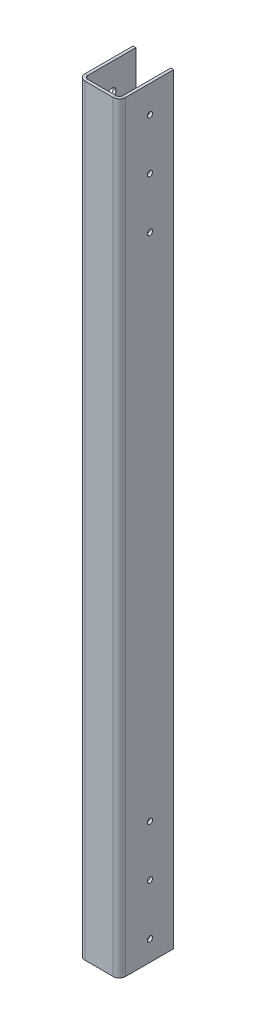
ISO-10303-21;
HEADER;
FILE_DESCRIPTION(('STEP AP214'),'2;1');
FILE_NAME('part.step','',(''),(''),'','','');
FILE_SCHEMA(('AUTOMOTIVE_DESIGN { 1 0 10303 214 1 1 1 1 }'));
ENDSEC;
DATA;
#1=APPLICATION_CONTEXT('core data for automotive mechanical design processes');
#2=APPLICATION_PROTOCOL_DEFINITION('international standard','automotive_design',2000,#1);
#3=PRODUCT_CONTEXT('',#1,'mechanical');
#4=PRODUCT('Part','Part','',(#3));
#5=PRODUCT_RELATED_PRODUCT_CATEGORY('part','',(#4));
#6=PRODUCT_DEFINITION_FORMATION('','',#4);
#7=PRODUCT_DEFINITION_CONTEXT('part definition',#1,'design');
#8=PRODUCT_DEFINITION('design','',#6,#7);
#9=PRODUCT_DEFINITION_SHAPE('','',#8);
#10=(LENGTH_UNIT() NAMED_UNIT(*) SI_UNIT(.MILLI.,.METRE.));
#11=(NAMED_UNIT(*) PLANE_ANGLE_UNIT() SI_UNIT($,.RADIAN.));
#12=(NAMED_UNIT(*) SI_UNIT($,.STERADIAN.) SOLID_ANGLE_UNIT());
#13=UNCERTAINTY_MEASURE_WITH_UNIT(LENGTH_MEASURE(1.E-05),#10,'distance_accuracy_value','');
#14=(GEOMETRIC_REPRESENTATION_CONTEXT(3) GLOBAL_UNCERTAINTY_ASSIGNED_CONTEXT((#13)) GLOBAL_UNIT_ASSIGNED_CONTEXT((#10,
#11,#12)) REPRESENTATION_CONTEXT('',''));
#15=CARTESIAN_POINT('',(0.,0.,0.));
#16=DIRECTION('',(0.,0.,1.));
#17=DIRECTION('',(1.,0.,0.));
#18=AXIS2_PLACEMENT_3D('',#15,#16,#17);
#19=CARTESIAN_POINT('',(0.,0.,0.));
#20=DIRECTION('',(1.,0.,0.));
#21=DIRECTION('',(0.,0.,-1.));
#22=AXIS2_PLACEMENT_3D('',#19,#20,#21);
#23=PLANE('',#22);
#24=DIRECTION('',(0.,0.,1.));
#25=VECTOR('',#24,1.);
#26=CARTESIAN_POINT('',(-1.76744437347232E-13,613.528929765886,-28.31592));
#27=LINE('',#26,#25);
#28=CARTESIAN_POINT('',(-2.55201478636315E-13,613.528929765886,-50.8));
#29=VERTEX_POINT('',#28);
#30=CARTESIAN_POINT('',(-5.22736697287371E-13,613.528929765886,-5.83183999999994));
#31=VERTEX_POINT('',#30);
#32=EDGE_CURVE('E181',#29,#31,#27,.T.);
#33=ORIENTED_EDGE('',*,*,#32,.F.);
#34=DIRECTION('',(0.,-1.,0.));
#35=VECTOR('',#34,1.);
#36=CARTESIAN_POINT('',(-1.6826817716975E-13,-97.6710702341137,-50.8));
#37=LINE('',#36,#35);
#38=CARTESIAN_POINT('',(-1.68179560951345E-13,-97.6710702341137,-50.8));
#39=VERTEX_POINT('',#38);
#40=EDGE_CURVE('E288',#39,#29,#37,.F.);
#41=ORIENTED_EDGE('',*,*,#40,.F.);
#42=DIRECTION('',(0.,0.,1.));
#43=VECTOR('',#42,1.);
#44=CARTESIAN_POINT('',(0.,-97.6710702341137,-2.65683999999999));
#45=LINE('',#44,#43);
#46=CARTESIAN_POINT('',(0.,-97.6710702341137,-5.83184000000002));
#47=VERTEX_POINT('',#46);
#48=EDGE_CURVE('E291',#47,#39,#45,.F.);
#49=ORIENTED_EDGE('',*,*,#48,.F.);
#50=DIRECTION('',(0.,1.,0.));
#51=VECTOR('',#50,1.);
#52=CARTESIAN_POINT('',(0.,-97.6710702341137,-5.83183999999998));
#53=LINE('',#52,#51);
#54=EDGE_CURVE('E298',#31,#47,#53,.F.);
#55=ORIENTED_EDGE('',*,*,#54,.F.);
#56=EDGE_LOOP('',(#33,#41,#49,#55));
#57=FACE_BOUND('',#56,.T.);
#58=CARTESIAN_POINT('',(-6.66133814775094E-13,492.878929765886,-28.5750000000001));
#59=DIRECTION('',(1.,0.,0.));
#60=DIRECTION('',(0.,0.,-1.));
#61=AXIS2_PLACEMENT_3D('',#58,#59,#60);
#62=CIRCLE('',#61,2.45744999999997);
#63=CARTESIAN_POINT('',(-6.57765190849019E-13,492.878929765886,-31.0324500000001));
#64=VERTEX_POINT('',#63);
#65=EDGE_CURVE('E225',#64,#64,#62,.T.);
#66=ORIENTED_EDGE('',*,*,#65,.T.);
#67=EDGE_LOOP('',(#66));
#68=FACE_BOUND('',#67,.T.);
#69=CARTESIAN_POINT('',(-6.66133814775094E-13,540.503929765886,-28.5750000000001));
#70=DIRECTION('',(1.,0.,0.));
#71=DIRECTION('',(0.,0.,-1.));
#72=AXIS2_PLACEMENT_3D('',#69,#70,#71);
#73=CIRCLE('',#72,2.45744999999997);
#74=CARTESIAN_POINT('',(-6.57765190849019E-13,540.503929765886,-31.0324500000001));
#75=VERTEX_POINT('',#74);
#76=EDGE_CURVE('E229',#75,#75,#73,.T.);
#77=ORIENTED_EDGE('',*,*,#76,.T.);
#78=EDGE_LOOP('',(#77));
#79=FACE_BOUND('',#78,.T.);
#80=CARTESIAN_POINT('',(-6.03683769639929E-13,16.6289297658863,-28.5750000000001));
#81=DIRECTION('',(1.,0.,0.));
#82=DIRECTION('',(0.,0.,-1.));
#83=AXIS2_PLACEMENT_3D('',#80,#81,#82);
#84=CIRCLE('',#83,2.45745);
#85=CARTESIAN_POINT('',(-5.95315145713854E-13,16.6289297658863,-31.0324500000001));
#86=VERTEX_POINT('',#85);
#87=EDGE_CURVE('E787',#86,#86,#84,.T.);
#88=ORIENTED_EDGE('',*,*,#87,.T.);
#89=EDGE_LOOP('',(#88));
#90=FACE_BOUND('',#89,.T.);
#91=CARTESIAN_POINT('',(-5.96744875736022E-13,-30.9960702341137,-28.5750000000001));
#92=DIRECTION('',(1.,0.,0.));
#93=DIRECTION('',(0.,0.,-1.));
#94=AXIS2_PLACEMENT_3D('',#91,#92,#93);
#95=CIRCLE('',#94,2.45745);
#96=CARTESIAN_POINT('',(-5.88376251809947E-13,-30.9960702341137,-31.0324500000001));
#97=VERTEX_POINT('',#96);
#98=EDGE_CURVE('E778',#97,#97,#95,.T.);
#99=ORIENTED_EDGE('',*,*,#98,.T.);
#100=EDGE_LOOP('',(#99));
#101=FACE_BOUND('',#100,.T.);
#102=CARTESIAN_POINT('',(-5.96744875736022E-13,-78.6210702341137,-28.5750000000001));
#103=DIRECTION('',(1.,0.,0.));
#104=DIRECTION('',(0.,0.,-1.));
#105=AXIS2_PLACEMENT_3D('',#102,#103,#104);
#106=CIRCLE('',#105,2.45745);
#107=CARTESIAN_POINT('',(-5.88376251809947E-13,-78.6210702341137,-31.0324500000001));
#108=VERTEX_POINT('',#107);
#109=EDGE_CURVE('E766',#108,#108,#106,.T.);
#110=ORIENTED_EDGE('',*,*,#109,.T.);
#111=EDGE_LOOP('',(#110));
#112=FACE_BOUND('',#111,.T.);
#113=CARTESIAN_POINT('',(-1.72887663934737E-13,588.128929765886,-28.5750000000001));
#114=DIRECTION('',(-1.,0.,0.));
#115=DIRECTION('',(0.,0.,1.));
#116=AXIS2_PLACEMENT_3D('',#113,#114,#115);
#117=CIRCLE('',#116,3.77037599999996);
#118=CARTESIAN_POINT('',(-1.59723466490315E-13,588.128929765886,-24.8046240000002));
#119=VERTEX_POINT('',#118);
#120=EDGE_CURVE('E810',#119,#119,#117,.T.);
#121=ORIENTED_EDGE('',*,*,#120,.F.);
#122=EDGE_LOOP('',(#121));
#123=FACE_BOUND('',#122,.T.);
#124=ADVANCED_FACE('F79',(#57,#68,#79,#90,#101,#112,#123),#23,.F.);
#125=CARTESIAN_POINT('',(0.,0.,-2.65684));
#126=DIRECTION('',(0.,0.,1.));
#127=DIRECTION('',(1.,0.,0.));
#128=AXIS2_PLACEMENT_3D('',#125,#126,#127);
#129=PLANE('',#128);
#130=DIRECTION('',(1.,0.,0.));
#131=VECTOR('',#130,1.);
#132=CARTESIAN_POINT('',(0.,613.528929765886,-2.65684));
#133=LINE('',#132,#131);
#134=CARTESIAN_POINT('',(5.8318399999999,613.528929765886,-2.65683999999994));
#135=VERTEX_POINT('',#134);
#136=CARTESIAN_POINT('',(32.26816,613.528929765886,-2.65684));
#137=VERTEX_POINT('',#136);
#138=EDGE_CURVE('E182',#135,#137,#133,.T.);
#139=ORIENTED_EDGE('',*,*,#138,.T.);
#140=DIRECTION('',(0.,-1.,0.));
#141=VECTOR('',#140,1.);
#142=CARTESIAN_POINT('',(32.26816,-97.6710702341137,-2.65683999999999));
#143=LINE('',#142,#141);
#144=CARTESIAN_POINT('',(32.26816,-97.6710702341136,-2.65683999999999));
#145=VERTEX_POINT('',#144);
#146=EDGE_CURVE('E208',#145,#137,#143,.F.);
#147=ORIENTED_EDGE('',*,*,#146,.F.);
#148=DIRECTION('',(1.,0.,0.));
#149=VECTOR('',#148,1.);
#150=CARTESIAN_POINT('',(0.,-97.6710702341137,-2.65684));
#151=LINE('',#150,#149);
#152=CARTESIAN_POINT('',(5.83184,-97.6710702341137,-2.65684000000003));
#153=VERTEX_POINT('',#152);
#154=EDGE_CURVE('E13',#153,#145,#151,.T.);
#155=ORIENTED_EDGE('',*,*,#154,.F.);
#156=DIRECTION('',(0.,1.,0.));
#157=VECTOR('',#156,1.);
#158=CARTESIAN_POINT('',(5.8318399999999,651.628929765886,-2.65683999999993));
#159=LINE('',#158,#157);
#160=EDGE_CURVE('E287',#135,#153,#159,.F.);
#161=ORIENTED_EDGE('',*,*,#160,.F.);
#162=EDGE_LOOP('',(#139,#147,#155,#161));
#163=FACE_BOUND('',#162,.T.);
#164=ADVANCED_FACE('F368',(#163),#129,.F.);
#165=CARTESIAN_POINT('',(0.,0.,0.));
#166=DIRECTION('',(0.,0.,1.));
#167=DIRECTION('',(1.,0.,0.));
#168=AXIS2_PLACEMENT_3D('',#165,#166,#167);
#169=PLANE('',#168);
#170=DIRECTION('',(0.,-1.,0.));
#171=VECTOR('',#170,1.);
#172=CARTESIAN_POINT('',(32.2681600000001,-97.6710702341137,0.));
#173=LINE('',#172,#171);
#174=CARTESIAN_POINT('',(32.2681600000001,-97.6710702341136,0.));
#175=VERTEX_POINT('',#174);
#176=CARTESIAN_POINT('',(32.26816,613.528929765886,0.));
#177=VERTEX_POINT('',#176);
#178=EDGE_CURVE('E197',#175,#177,#173,.F.);
#179=ORIENTED_EDGE('',*,*,#178,.T.);
#180=DIRECTION('',(1.,0.,0.));
#181=VECTOR('',#180,1.);
#182=CARTESIAN_POINT('',(0.,613.528929765886,0.));
#183=LINE('',#182,#181);
#184=CARTESIAN_POINT('',(5.83183999999995,613.528929765886,0.));
#185=VERTEX_POINT('',#184);
#186=EDGE_CURVE('E173',#185,#177,#183,.T.);
#187=ORIENTED_EDGE('',*,*,#186,.F.);
#188=DIRECTION('',(0.,1.,0.));
#189=VECTOR('',#188,1.);
#190=CARTESIAN_POINT('',(5.8318399999999,651.628929765886,0.));
#191=LINE('',#190,#189);
#192=CARTESIAN_POINT('',(5.83184,-97.6710702341137,0.));
#193=VERTEX_POINT('',#192);
#194=EDGE_CURVE('E104',#185,#193,#191,.F.);
#195=ORIENTED_EDGE('',*,*,#194,.T.);
#196=DIRECTION('',(1.,0.,0.));
#197=VECTOR('',#196,1.);
#198=CARTESIAN_POINT('',(0.,-97.6710702341137,0.));
#199=LINE('',#198,#197);
#200=EDGE_CURVE('E88',#193,#175,#199,.T.);
#201=ORIENTED_EDGE('',*,*,#200,.T.);
#202=EDGE_LOOP('',(#179,#187,#195,#201));
#203=FACE_BOUND('',#202,.T.);
#204=ADVANCED_FACE('F201',(#203),#169,.T.);
#205=CARTESIAN_POINT('',(32.26816,-97.6710702341137,-5.83183999999994));
#206=DIRECTION('',(0.,-1.,0.));
#207=DIRECTION('',(1.,0.,0.));
#208=AXIS2_PLACEMENT_3D('',#205,#206,#207);
#209=CYLINDRICAL_SURFACE('',#208,5.83183999999995);
#210=DIRECTION('',(0.,-1.,0.));
#211=VECTOR('',#210,1.);
#212=CARTESIAN_POINT('',(38.1,0.,-5.83183999999996));
#213=LINE('',#212,#211);
#214=CARTESIAN_POINT('',(38.0999999999999,613.528929765886,-5.83183999999998));
#215=VERTEX_POINT('',#214);
#216=CARTESIAN_POINT('',(38.1,-97.6710702341136,-5.83183999999995));
#217=VERTEX_POINT('',#216);
#218=EDGE_CURVE('E199',#215,#217,#213,.T.);
#219=ORIENTED_EDGE('',*,*,#218,.F.);
#220=CARTESIAN_POINT('',(32.26816,613.528929765886,-5.83184000000003));
#221=DIRECTION('',(0.,-1.,0.));
#222=DIRECTION('',(1.,0.,0.));
#223=AXIS2_PLACEMENT_3D('',#220,#221,#222);
#224=CIRCLE('',#223,5.83183999999995);
#225=EDGE_CURVE('E188',#177,#215,#224,.F.);
#226=ORIENTED_EDGE('',*,*,#225,.F.);
#227=ORIENTED_EDGE('',*,*,#178,.F.);
#228=CARTESIAN_POINT('',(32.26816,-97.6710702341136,-5.83183999999994));
#229=DIRECTION('',(0.,-1.,0.));
#230=DIRECTION('',(0.,0.,-1.));
#231=AXIS2_PLACEMENT_3D('',#228,#229,#230);
#232=CIRCLE('',#231,5.83183999999995);
#233=EDGE_CURVE('E205',#217,#175,#232,.T.);
#234=ORIENTED_EDGE('',*,*,#233,.F.);
#235=EDGE_LOOP('',(#219,#226,#227,#234));
#236=FACE_BOUND('',#235,.T.);
#237=ADVANCED_FACE('F195',(#236),#209,.T.);
#238=CARTESIAN_POINT('',(32.26816,-97.6710702341137,-5.83183999999994));
#239=DIRECTION('',(0.,-1.,0.));
#240=DIRECTION('',(1.,0.,0.));
#241=AXIS2_PLACEMENT_3D('',#238,#239,#240);
#242=CYLINDRICAL_SURFACE('',#241,3.17499999999995);
#243=CARTESIAN_POINT('',(32.26816,613.528929765886,-5.83184000000003));
#244=DIRECTION('',(0.,-1.,0.));
#245=DIRECTION('',(0.,0.,-1.));
#246=AXIS2_PLACEMENT_3D('',#243,#244,#245);
#247=CIRCLE('',#246,3.17499999999995);
#248=CARTESIAN_POINT('',(35.4431599999999,613.528929765886,-5.83184));
#249=VERTEX_POINT('',#248);
#250=EDGE_CURVE('E190',#137,#249,#247,.F.);
#251=ORIENTED_EDGE('',*,*,#250,.T.);
#252=DIRECTION('',(0.,1.,0.));
#253=VECTOR('',#252,1.);
#254=CARTESIAN_POINT('',(35.4431599999999,651.628929765886,-5.83183999999999));
#255=LINE('',#254,#253);
#256=CARTESIAN_POINT('',(35.4431599999999,-97.6710702341136,-5.83183999999993));
#257=VERTEX_POINT('',#256);
#258=EDGE_CURVE('E211',#249,#257,#255,.F.);
#259=ORIENTED_EDGE('',*,*,#258,.T.);
#260=CARTESIAN_POINT('',(32.26816,-97.6710702341136,-5.83183999999994));
#261=DIRECTION('',(0.,-1.,0.));
#262=DIRECTION('',(0.,0.,-1.));
#263=AXIS2_PLACEMENT_3D('',#260,#261,#262);
#264=CIRCLE('',#263,3.17499999999995);
#265=EDGE_CURVE('E216',#257,#145,#264,.T.);
#266=ORIENTED_EDGE('',*,*,#265,.T.);
#267=ORIENTED_EDGE('',*,*,#146,.T.);
#268=EDGE_LOOP('',(#251,#259,#266,#267));
#269=FACE_BOUND('',#268,.T.);
#270=ADVANCED_FACE('F335',(#269),#242,.F.);
#271=CARTESIAN_POINT('',(38.1,0.,1.41069163954693E-13));
#272=DIRECTION('',(1.,0.,0.));
#273=DIRECTION('',(0.,0.,-1.));
#274=AXIS2_PLACEMENT_3D('',#271,#272,#273);
#275=PLANE('',#274);
#276=CARTESIAN_POINT('',(38.1000000000001,-78.6210702341137,-28.575));
#277=DIRECTION('',(1.,0.,0.));
#278=DIRECTION('',(0.,0.,-1.));
#279=AXIS2_PLACEMENT_3D('',#276,#277,#278);
#280=CIRCLE('',#279,2.45745);
#281=CARTESIAN_POINT('',(38.1000000000001,-78.6210702341137,-31.03245));
#282=VERTEX_POINT('',#281);
#283=EDGE_CURVE('E772',#282,#282,#280,.T.);
#284=ORIENTED_EDGE('',*,*,#283,.F.);
#285=EDGE_LOOP('',(#284));
#286=FACE_BOUND('',#285,.T.);
#287=CARTESIAN_POINT('',(38.1000000000001,-30.9960702341137,-28.575));
#288=DIRECTION('',(1.,0.,0.));
#289=DIRECTION('',(0.,0.,-1.));
#290=AXIS2_PLACEMENT_3D('',#287,#288,#289);
#291=CIRCLE('',#290,2.45745);
#292=CARTESIAN_POINT('',(38.1000000000001,-30.9960702341137,-31.03245));
#293=VERTEX_POINT('',#292);
#294=EDGE_CURVE('E769',#293,#293,#291,.T.);
#295=ORIENTED_EDGE('',*,*,#294,.F.);
#296=EDGE_LOOP('',(#295));
#297=FACE_BOUND('',#296,.T.);
#298=CARTESIAN_POINT('',(38.1000000000001,16.6289297658863,-28.575));
#299=DIRECTION('',(1.,0.,0.));
#300=DIRECTION('',(0.,0.,-1.));
#301=AXIS2_PLACEMENT_3D('',#298,#299,#300);
#302=CIRCLE('',#301,2.45745);
#303=CARTESIAN_POINT('',(38.1000000000001,16.6289297658863,-31.03245));
#304=VERTEX_POINT('',#303);
#305=EDGE_CURVE('E785',#304,#304,#302,.T.);
#306=ORIENTED_EDGE('',*,*,#305,.F.);
#307=EDGE_LOOP('',(#306));
#308=FACE_BOUND('',#307,.T.);
#309=CARTESIAN_POINT('',(38.1,588.128929765886,-28.575));
#310=DIRECTION('',(1.,0.,0.));
#311=DIRECTION('',(0.,0.,-1.));
#312=AXIS2_PLACEMENT_3D('',#309,#310,#311);
#313=CIRCLE('',#312,2.45744999999997);
#314=CARTESIAN_POINT('',(38.1,588.128929765886,-31.03245));
#315=VERTEX_POINT('',#314);
#316=EDGE_CURVE('E233',#315,#315,#313,.T.);
#317=ORIENTED_EDGE('',*,*,#316,.F.);
#318=EDGE_LOOP('',(#317));
#319=FACE_BOUND('',#318,.T.);
#320=CARTESIAN_POINT('',(38.1,540.503929765886,-28.575));
#321=DIRECTION('',(1.,0.,0.));
#322=DIRECTION('',(0.,0.,-1.));
#323=AXIS2_PLACEMENT_3D('',#320,#321,#322);
#324=CIRCLE('',#323,2.45744999999997);
#325=CARTESIAN_POINT('',(38.1,540.503929765886,-31.03245));
#326=VERTEX_POINT('',#325);
#327=EDGE_CURVE('E232',#326,#326,#324,.T.);
#328=ORIENTED_EDGE('',*,*,#327,.F.);
#329=EDGE_LOOP('',(#328));
#330=FACE_BOUND('',#329,.T.);
#331=CARTESIAN_POINT('',(38.1,492.878929765886,-28.575));
#332=DIRECTION('',(1.,0.,0.));
#333=DIRECTION('',(0.,0.,-1.));
#334=AXIS2_PLACEMENT_3D('',#331,#332,#333);
#335=CIRCLE('',#334,2.45744999999997);
#336=CARTESIAN_POINT('',(38.1,492.878929765886,-31.03245));
#337=VERTEX_POINT('',#336);
#338=EDGE_CURVE('E251',#337,#337,#335,.T.);
#339=ORIENTED_EDGE('',*,*,#338,.F.);
#340=EDGE_LOOP('',(#339));
#341=FACE_BOUND('',#340,.T.);
#342=DIRECTION('',(0.,-1.,0.));
#343=VECTOR('',#342,1.);
#344=CARTESIAN_POINT('',(38.1000000000002,-97.6710702341137,-50.8));
#345=LINE('',#344,#343);
#346=CARTESIAN_POINT('',(38.1000000000001,613.528929765886,-50.8));
#347=VERTEX_POINT('',#346);
#348=CARTESIAN_POINT('',(38.1000000000002,-97.6710702341137,-50.8));
#349=VERTEX_POINT('',#348);
#350=EDGE_CURVE('E321',#347,#349,#345,.T.);
#351=ORIENTED_EDGE('',*,*,#350,.F.);
#352=DIRECTION('',(0.,0.,1.));
#353=VECTOR('',#352,1.);
#354=CARTESIAN_POINT('',(38.0999999999999,613.528929765886,1.40983211879829E-13));
#355=LINE('',#354,#353);
#356=EDGE_CURVE('E261',#347,#215,#355,.T.);
#357=ORIENTED_EDGE('',*,*,#356,.T.);
#358=ORIENTED_EDGE('',*,*,#218,.T.);
#359=DIRECTION('',(0.,0.,1.));
#360=VECTOR('',#359,1.);
#361=CARTESIAN_POINT('',(38.1,-97.6710702341137,-2.65683999999999));
#362=LINE('',#361,#360);
#363=EDGE_CURVE('E318',#349,#217,#362,.T.);
#364=ORIENTED_EDGE('',*,*,#363,.F.);
#365=EDGE_LOOP('',(#351,#357,#358,#364));
#366=FACE_BOUND('',#365,.T.);
#367=ADVANCED_FACE('F349',(#286,#297,#308,#319,#330,#341,#366),#275,.T.);
#368=CARTESIAN_POINT('',(35.44316,0.,1.31792856674401E-13));
#369=DIRECTION('',(1.,0.,0.));
#370=DIRECTION('',(0.,0.,-1.));
#371=AXIS2_PLACEMENT_3D('',#368,#369,#370);
#372=PLANE('',#371);
#373=CARTESIAN_POINT('',(35.44316,588.128929765886,-28.575));
#374=DIRECTION('',(1.,0.,0.));
#375=DIRECTION('',(0.,0.,-1.));
#376=AXIS2_PLACEMENT_3D('',#373,#374,#375);
#377=CIRCLE('',#376,2.45744999999997);
#378=CARTESIAN_POINT('',(35.44316,588.128929765886,-31.03245));
#379=VERTEX_POINT('',#378);
#380=EDGE_CURVE('E230',#379,#379,#377,.T.);
#381=ORIENTED_EDGE('',*,*,#380,.T.);
#382=EDGE_LOOP('',(#381));
#383=FACE_BOUND('',#382,.T.);
#384=DIRECTION('',(0.,0.,1.));
#385=VECTOR('',#384,1.);
#386=CARTESIAN_POINT('',(35.44316,613.528929765886,-28.31592));
#387=LINE('',#386,#385);
#388=CARTESIAN_POINT('',(35.4431600000001,613.528929765886,-50.8));
#389=VERTEX_POINT('',#388);
#390=EDGE_CURVE('E257',#389,#249,#387,.T.);
#391=ORIENTED_EDGE('',*,*,#390,.F.);
#392=DIRECTION('',(0.,1.,0.));
#393=VECTOR('',#392,1.);
#394=CARTESIAN_POINT('',(35.4431600000002,0.,-50.8));
#395=LINE('',#394,#393);
#396=CARTESIAN_POINT('',(35.4431600000002,-97.6710702341137,-50.8));
#397=VERTEX_POINT('',#396);
#398=EDGE_CURVE('E326',#389,#397,#395,.F.);
#399=ORIENTED_EDGE('',*,*,#398,.T.);
#400=DIRECTION('',(0.,0.,-1.));
#401=VECTOR('',#400,1.);
#402=CARTESIAN_POINT('',(35.44316,-97.6710702341137,0.));
#403=LINE('',#402,#401);
#404=EDGE_CURVE('E323',#397,#257,#403,.F.);
#405=ORIENTED_EDGE('',*,*,#404,.T.);
#406=ORIENTED_EDGE('',*,*,#258,.F.);
#407=EDGE_LOOP('',(#391,#399,#405,#406));
#408=FACE_BOUND('',#407,.T.);
#409=CARTESIAN_POINT('',(35.44316,492.878929765886,-28.575));
#410=DIRECTION('',(1.,0.,0.));
#411=DIRECTION('',(0.,0.,-1.));
#412=AXIS2_PLACEMENT_3D('',#409,#410,#411);
#413=CIRCLE('',#412,2.45744999999997);
#414=CARTESIAN_POINT('',(35.44316,492.878929765886,-31.03245));
#415=VERTEX_POINT('',#414);
#416=EDGE_CURVE('E221',#415,#415,#413,.T.);
#417=ORIENTED_EDGE('',*,*,#416,.T.);
#418=EDGE_LOOP('',(#417));
#419=FACE_BOUND('',#418,.T.);
#420=CARTESIAN_POINT('',(35.44316,540.503929765886,-28.575));
#421=DIRECTION('',(1.,0.,0.));
#422=DIRECTION('',(0.,0.,-1.));
#423=AXIS2_PLACEMENT_3D('',#420,#421,#422);
#424=CIRCLE('',#423,2.45744999999997);
#425=CARTESIAN_POINT('',(35.44316,540.503929765886,-31.03245));
#426=VERTEX_POINT('',#425);
#427=EDGE_CURVE('E228',#426,#426,#424,.T.);
#428=ORIENTED_EDGE('',*,*,#427,.T.);
#429=EDGE_LOOP('',(#428));
#430=FACE_BOUND('',#429,.T.);
#431=CARTESIAN_POINT('',(35.4431600000001,16.6289297658863,-28.575));
#432=DIRECTION('',(1.,0.,0.));
#433=DIRECTION('',(0.,0.,-1.));
#434=AXIS2_PLACEMENT_3D('',#431,#432,#433);
#435=CIRCLE('',#434,2.45745);
#436=CARTESIAN_POINT('',(35.4431600000001,16.6289297658863,-31.03245));
#437=VERTEX_POINT('',#436);
#438=EDGE_CURVE('E239',#437,#437,#435,.T.);
#439=ORIENTED_EDGE('',*,*,#438,.T.);
#440=EDGE_LOOP('',(#439));
#441=FACE_BOUND('',#440,.T.);
#442=CARTESIAN_POINT('',(35.4431600000001,-30.9960702341137,-28.575));
#443=DIRECTION('',(1.,0.,0.));
#444=DIRECTION('',(0.,0.,-1.));
#445=AXIS2_PLACEMENT_3D('',#442,#443,#444);
#446=CIRCLE('',#445,2.45745);
#447=CARTESIAN_POINT('',(35.4431600000001,-30.9960702341137,-31.03245));
#448=VERTEX_POINT('',#447);
#449=EDGE_CURVE('E760',#448,#448,#446,.T.);
#450=ORIENTED_EDGE('',*,*,#449,.T.);
#451=EDGE_LOOP('',(#450));
#452=FACE_BOUND('',#451,.T.);
#453=CARTESIAN_POINT('',(35.4431600000001,-78.6210702341137,-28.575));
#454=DIRECTION('',(1.,0.,0.));
#455=DIRECTION('',(0.,0.,-1.));
#456=AXIS2_PLACEMENT_3D('',#453,#454,#455);
#457=CIRCLE('',#456,2.45745);
#458=CARTESIAN_POINT('',(35.4431600000001,-78.6210702341137,-31.03245));
#459=VERTEX_POINT('',#458);
#460=EDGE_CURVE('E763',#459,#459,#457,.T.);
#461=ORIENTED_EDGE('',*,*,#460,.T.);
#462=EDGE_LOOP('',(#461));
#463=FACE_BOUND('',#462,.T.);
#464=ADVANCED_FACE('F340',(#383,#408,#419,#430,#441,#452,#463),#372,.F.);
#465=CARTESIAN_POINT('',(38.1000000000002,-97.6710702341137,-50.8));
#466=DIRECTION('',(0.,0.,-1.));
#467=DIRECTION('',(-1.,0.,0.));
#468=AXIS2_PLACEMENT_3D('',#465,#466,#467);
#469=PLANE('',#468);
#470=ORIENTED_EDGE('',*,*,#398,.F.);
#471=DIRECTION('',(-1.,0.,0.));
#472=VECTOR('',#471,1.);
#473=CARTESIAN_POINT('',(38.1000000000001,613.528929765886,-50.8));
#474=LINE('',#473,#472);
#475=EDGE_CURVE('E260',#389,#347,#474,.F.);
#476=ORIENTED_EDGE('',*,*,#475,.T.);
#477=ORIENTED_EDGE('',*,*,#350,.T.);
#478=DIRECTION('',(-1.,0.,0.));
#479=VECTOR('',#478,1.);
#480=CARTESIAN_POINT('',(38.1000000000002,-97.6710702341137,-50.8));
#481=LINE('',#480,#479);
#482=EDGE_CURVE('E218',#349,#397,#481,.T.);
#483=ORIENTED_EDGE('',*,*,#482,.T.);
#484=EDGE_LOOP('',(#470,#476,#477,#483));
#485=FACE_BOUND('',#484,.T.);
#486=ADVANCED_FACE('F353',(#485),#469,.T.);
#487=CARTESIAN_POINT('',(5.83183999999989,651.628929765886,-5.83183999999994));
#488=DIRECTION('',(0.,1.,0.));
#489=DIRECTION('',(-1.,0.,0.));
#490=AXIS2_PLACEMENT_3D('',#487,#488,#489);
#491=CYLINDRICAL_SURFACE('',#490,5.83184000000001);
#492=ORIENTED_EDGE('',*,*,#194,.F.);
#493=CARTESIAN_POINT('',(5.8318399999999,613.528929765885,-5.83183999999994));
#494=DIRECTION('',(0.,1.,0.));
#495=DIRECTION('',(0.,0.,1.));
#496=AXIS2_PLACEMENT_3D('',#493,#494,#495);
#497=CIRCLE('',#496,5.83184);
#498=EDGE_CURVE('E276',#31,#185,#497,.T.);
#499=ORIENTED_EDGE('',*,*,#498,.F.);
#500=ORIENTED_EDGE('',*,*,#54,.T.);
#501=CARTESIAN_POINT('',(5.83183999999999,-97.6710702341137,-5.83184000000004));
#502=DIRECTION('',(0.,1.,0.));
#503=DIRECTION('',(0.,0.,1.));
#504=AXIS2_PLACEMENT_3D('',#501,#502,#503);
#505=CIRCLE('',#504,5.83184000000001);
#506=EDGE_CURVE('E306',#193,#47,#505,.F.);
#507=ORIENTED_EDGE('',*,*,#506,.F.);
#508=EDGE_LOOP('',(#492,#499,#500,#507));
#509=FACE_BOUND('',#508,.T.);
#510=ADVANCED_FACE('F355',(#509),#491,.T.);
#511=CARTESIAN_POINT('',(5.83183999999989,651.628929765886,-5.83183999999994));
#512=DIRECTION('',(0.,1.,0.));
#513=DIRECTION('',(-1.,0.,0.));
#514=AXIS2_PLACEMENT_3D('',#511,#512,#513);
#515=CYLINDRICAL_SURFACE('',#514,3.17500000000001);
#516=CARTESIAN_POINT('',(5.8318399999999,613.528929765886,-5.83183999999994));
#517=DIRECTION('',(0.,1.,0.));
#518=DIRECTION('',(0.,0.,1.));
#519=AXIS2_PLACEMENT_3D('',#516,#517,#518);
#520=CIRCLE('',#519,3.175);
#521=CARTESIAN_POINT('',(2.6568399999999,613.528929765886,-5.83183999999997));
#522=VERTEX_POINT('',#521);
#523=EDGE_CURVE('E191',#522,#135,#520,.T.);
#524=ORIENTED_EDGE('',*,*,#523,.T.);
#525=ORIENTED_EDGE('',*,*,#160,.T.);
#526=CARTESIAN_POINT('',(5.83183999999999,-97.6710702341137,-5.83184000000004));
#527=DIRECTION('',(0.,1.,0.));
#528=DIRECTION('',(0.,0.,1.));
#529=AXIS2_PLACEMENT_3D('',#526,#527,#528);
#530=CIRCLE('',#529,3.17500000000001);
#531=CARTESIAN_POINT('',(2.65683999999999,-97.6710702341137,-5.83184000000003));
#532=VERTEX_POINT('',#531);
#533=EDGE_CURVE('E307',#153,#532,#530,.F.);
#534=ORIENTED_EDGE('',*,*,#533,.T.);
#535=DIRECTION('',(0.,1.,0.));
#536=VECTOR('',#535,1.);
#537=CARTESIAN_POINT('',(2.65683999999999,-97.6710702341137,-5.83183999999999));
#538=LINE('',#537,#536);
#539=EDGE_CURVE('E300',#532,#522,#538,.T.);
#540=ORIENTED_EDGE('',*,*,#539,.T.);
#541=EDGE_LOOP('',(#524,#525,#534,#540));
#542=FACE_BOUND('',#541,.T.);
#543=ADVANCED_FACE('F361',(#542),#515,.F.);
#544=CARTESIAN_POINT('',(2.65684,0.,0.));
#545=DIRECTION('',(1.,0.,0.));
#546=DIRECTION('',(0.,0.,-1.));
#547=AXIS2_PLACEMENT_3D('',#544,#545,#546);
#548=PLANE('',#547);
#549=CARTESIAN_POINT('',(2.65683999999983,588.128929765886,-28.5750000000001));
#550=DIRECTION('',(1.,0.,0.));
#551=DIRECTION('',(0.,0.,-1.));
#552=AXIS2_PLACEMENT_3D('',#549,#550,#551);
#553=CIRCLE('',#552,3.77037599999996);
#554=CARTESIAN_POINT('',(2.65683999999981,588.128929765886,-32.3453760000001));
#555=VERTEX_POINT('',#554);
#556=EDGE_CURVE('E812',#555,#555,#553,.T.);
#557=ORIENTED_EDGE('',*,*,#556,.F.);
#558=EDGE_LOOP('',(#557));
#559=FACE_BOUND('',#558,.T.);
#560=CARTESIAN_POINT('',(2.65683999999991,-78.6210702341137,-28.5750000000001));
#561=DIRECTION('',(1.,0.,0.));
#562=DIRECTION('',(0.,0.,-1.));
#563=AXIS2_PLACEMENT_3D('',#560,#561,#562);
#564=CIRCLE('',#563,2.45745);
#565=CARTESIAN_POINT('',(2.6568399999999,-78.6210702341137,-31.0324500000001));
#566=VERTEX_POINT('',#565);
#567=EDGE_CURVE('E765',#566,#566,#564,.T.);
#568=ORIENTED_EDGE('',*,*,#567,.F.);
#569=EDGE_LOOP('',(#568));
#570=FACE_BOUND('',#569,.T.);
#571=CARTESIAN_POINT('',(2.65683999999991,-30.9960702341137,-28.5750000000001));
#572=DIRECTION('',(1.,0.,0.));
#573=DIRECTION('',(0.,0.,-1.));
#574=AXIS2_PLACEMENT_3D('',#571,#572,#573);
#575=CIRCLE('',#574,2.45745);
#576=CARTESIAN_POINT('',(2.6568399999999,-30.9960702341137,-31.0324500000001));
#577=VERTEX_POINT('',#576);
#578=EDGE_CURVE('E782',#577,#577,#575,.T.);
#579=ORIENTED_EDGE('',*,*,#578,.F.);
#580=EDGE_LOOP('',(#579));
#581=FACE_BOUND('',#580,.T.);
#582=CARTESIAN_POINT('',(2.6568399999999,16.6289297658863,-28.5750000000001));
#583=DIRECTION('',(1.,0.,0.));
#584=DIRECTION('',(0.,0.,-1.));
#585=AXIS2_PLACEMENT_3D('',#582,#583,#584);
#586=CIRCLE('',#585,2.45745);
#587=CARTESIAN_POINT('',(2.65683999999989,16.6289297658863,-31.0324500000001));
#588=VERTEX_POINT('',#587);
#589=EDGE_CURVE('E83',#588,#588,#586,.T.);
#590=ORIENTED_EDGE('',*,*,#589,.F.);
#591=EDGE_LOOP('',(#590));
#592=FACE_BOUND('',#591,.T.);
#593=CARTESIAN_POINT('',(2.65683999999983,540.503929765886,-28.5750000000001));
#594=DIRECTION('',(1.,0.,0.));
#595=DIRECTION('',(0.,0.,-1.));
#596=AXIS2_PLACEMENT_3D('',#593,#594,#595);
#597=CIRCLE('',#596,2.45744999999997);
#598=CARTESIAN_POINT('',(2.65683999999983,540.503929765886,-31.0324500000001));
#599=VERTEX_POINT('',#598);
#600=EDGE_CURVE('E226',#599,#599,#597,.T.);
#601=ORIENTED_EDGE('',*,*,#600,.F.);
#602=EDGE_LOOP('',(#601));
#603=FACE_BOUND('',#602,.T.);
#604=CARTESIAN_POINT('',(2.65683999999984,492.878929765886,-28.5750000000001));
#605=DIRECTION('',(1.,0.,0.));
#606=DIRECTION('',(0.,0.,-1.));
#607=AXIS2_PLACEMENT_3D('',#604,#605,#606);
#608=CIRCLE('',#607,2.45744999999997);
#609=CARTESIAN_POINT('',(2.65683999999983,492.878929765886,-31.0324500000001));
#610=VERTEX_POINT('',#609);
#611=EDGE_CURVE('E224',#610,#610,#608,.T.);
#612=ORIENTED_EDGE('',*,*,#611,.F.);
#613=EDGE_LOOP('',(#612));
#614=FACE_BOUND('',#613,.T.);
#615=DIRECTION('',(0.,1.,0.));
#616=VECTOR('',#615,1.);
#617=CARTESIAN_POINT('',(2.65683999999982,0.,-50.8));
#618=LINE('',#617,#616);
#619=CARTESIAN_POINT('',(2.65683999999983,-97.6710702341137,-50.8));
#620=VERTEX_POINT('',#619);
#621=CARTESIAN_POINT('',(2.65683999999974,613.528929765886,-50.8));
#622=VERTEX_POINT('',#621);
#623=EDGE_CURVE('E293',#620,#622,#618,.T.);
#624=ORIENTED_EDGE('',*,*,#623,.T.);
#625=DIRECTION('',(0.,0.,1.));
#626=VECTOR('',#625,1.);
#627=CARTESIAN_POINT('',(2.65683999999992,613.528929765886,-1.90500000000014));
#628=LINE('',#627,#626);
#629=EDGE_CURVE('E96',#622,#522,#628,.T.);
#630=ORIENTED_EDGE('',*,*,#629,.T.);
#631=ORIENTED_EDGE('',*,*,#539,.F.);
#632=DIRECTION('',(0.,0.,-1.));
#633=VECTOR('',#632,1.);
#634=CARTESIAN_POINT('',(2.65684000000001,-97.6710702341137,0.));
#635=LINE('',#634,#633);
#636=EDGE_CURVE('E296',#532,#620,#635,.T.);
#637=ORIENTED_EDGE('',*,*,#636,.T.);
#638=EDGE_LOOP('',(#624,#630,#631,#637));
#639=FACE_BOUND('',#638,.T.);
#640=ADVANCED_FACE('F381',(#559,#570,#581,#592,#603,#614,#639),#548,.T.);
#641=CARTESIAN_POINT('',(-1.6826817716975E-13,-97.6710702341137,-50.8));
#642=DIRECTION('',(0.,0.,-1.));
#643=DIRECTION('',(-1.,0.,0.));
#644=AXIS2_PLACEMENT_3D('',#641,#642,#643);
#645=PLANE('',#644);
#646=ORIENTED_EDGE('',*,*,#40,.T.);
#647=DIRECTION('',(-1.,0.,0.));
#648=VECTOR('',#647,1.);
#649=CARTESIAN_POINT('',(2.65683999999974,613.528929765886,-50.8));
#650=LINE('',#649,#648);
#651=EDGE_CURVE('E269',#29,#622,#650,.F.);
#652=ORIENTED_EDGE('',*,*,#651,.T.);
#653=ORIENTED_EDGE('',*,*,#623,.F.);
#654=DIRECTION('',(1.,0.,0.));
#655=VECTOR('',#654,1.);
#656=CARTESIAN_POINT('',(-1.68090944732939E-13,-97.6710702341137,-50.8));
#657=LINE('',#656,#655);
#658=EDGE_CURVE('E284',#39,#620,#657,.T.);
#659=ORIENTED_EDGE('',*,*,#658,.F.);
#660=EDGE_LOOP('',(#646,#652,#653,#659));
#661=FACE_BOUND('',#660,.T.);
#662=ADVANCED_FACE('F384',(#661),#645,.T.);
#663=CARTESIAN_POINT('',(0.,-97.6710702341137,-2.65684));
#664=DIRECTION('',(0.,-1.,0.));
#665=DIRECTION('',(0.,0.,-1.));
#666=AXIS2_PLACEMENT_3D('',#663,#664,#665);
#667=PLANE('',#666);
#668=DIRECTION('',(0.,0.,1.));
#669=VECTOR('',#668,1.);
#670=CARTESIAN_POINT('',(5.83184,-97.6710702341137,-2.65684000000003));
#671=LINE('',#670,#669);
#672=EDGE_CURVE('E310',#153,#193,#671,.T.);
#673=ORIENTED_EDGE('',*,*,#672,.F.);
#674=ORIENTED_EDGE('',*,*,#154,.T.);
#675=DIRECTION('',(0.,0.,1.));
#676=VECTOR('',#675,1.);
#677=CARTESIAN_POINT('',(32.26816,-97.6710702341136,-2.65683999999999));
#678=LINE('',#677,#676);
#679=EDGE_CURVE('E204',#145,#175,#678,.T.);
#680=ORIENTED_EDGE('',*,*,#679,.T.);
#681=ORIENTED_EDGE('',*,*,#200,.F.);
#682=EDGE_LOOP('',(#673,#674,#680,#681));
#683=FACE_BOUND('',#682,.T.);
#684=ADVANCED_FACE('F81',(#683),#667,.T.);
#685=CARTESIAN_POINT('',(32.26816,-97.6710702341136,-5.83183999999994));
#686=DIRECTION('',(0.,1.,0.));
#687=DIRECTION('',(0.,0.,1.));
#688=AXIS2_PLACEMENT_3D('',#685,#686,#687);
#689=PLANE('',#688);
#690=ORIENTED_EDGE('',*,*,#265,.F.);
#691=DIRECTION('',(1.,0.,0.));
#692=VECTOR('',#691,1.);
#693=CARTESIAN_POINT('',(35.44316,-97.6710702341136,-5.83183999999996));
#694=LINE('',#693,#692);
#695=EDGE_CURVE('E328',#257,#217,#694,.T.);
#696=ORIENTED_EDGE('',*,*,#695,.T.);
#697=ORIENTED_EDGE('',*,*,#233,.T.);
#698=ORIENTED_EDGE('',*,*,#679,.F.);
#699=EDGE_LOOP('',(#690,#696,#697,#698));
#700=FACE_BOUND('',#699,.T.);
#701=ADVANCED_FACE('F338',(#700),#689,.F.);
#702=CARTESIAN_POINT('',(38.1,-97.6710702341137,-2.65683999999999));
#703=DIRECTION('',(0.,-1.,0.));
#704=DIRECTION('',(0.,0.,-1.));
#705=AXIS2_PLACEMENT_3D('',#702,#703,#704);
#706=PLANE('',#705);
#707=ORIENTED_EDGE('',*,*,#363,.T.);
#708=ORIENTED_EDGE('',*,*,#695,.F.);
#709=ORIENTED_EDGE('',*,*,#404,.F.);
#710=ORIENTED_EDGE('',*,*,#482,.F.);
#711=EDGE_LOOP('',(#707,#708,#709,#710));
#712=FACE_BOUND('',#711,.T.);
#713=ADVANCED_FACE('F345',(#712),#706,.T.);
#714=CARTESIAN_POINT('',(5.83183999999999,-97.6710702341137,-5.83184000000004));
#715=DIRECTION('',(0.,-1.,0.));
#716=DIRECTION('',(0.,0.,-1.));
#717=AXIS2_PLACEMENT_3D('',#714,#715,#716);
#718=PLANE('',#717);
#719=DIRECTION('',(-1.,0.,0.));
#720=VECTOR('',#719,1.);
#721=CARTESIAN_POINT('',(0.,-97.6710702341137,-5.83183999999998));
#722=LINE('',#721,#720);
#723=EDGE_CURVE('E283',#532,#47,#722,.T.);
#724=ORIENTED_EDGE('',*,*,#723,.F.);
#725=ORIENTED_EDGE('',*,*,#533,.F.);
#726=ORIENTED_EDGE('',*,*,#672,.T.);
#727=ORIENTED_EDGE('',*,*,#506,.T.);
#728=EDGE_LOOP('',(#724,#725,#726,#727));
#729=FACE_BOUND('',#728,.T.);
#730=ADVANCED_FACE('F391',(#729),#718,.T.);
#731=CARTESIAN_POINT('',(0.,-97.6710702341137,-2.65683999999999));
#732=DIRECTION('',(0.,-1.,0.));
#733=DIRECTION('',(1.,0.,0.));
#734=AXIS2_PLACEMENT_3D('',#731,#732,#733);
#735=PLANE('',#734);
#736=ORIENTED_EDGE('',*,*,#636,.F.);
#737=ORIENTED_EDGE('',*,*,#723,.T.);
#738=ORIENTED_EDGE('',*,*,#48,.T.);
#739=ORIENTED_EDGE('',*,*,#658,.T.);
#740=EDGE_LOOP('',(#736,#737,#738,#739));
#741=FACE_BOUND('',#740,.T.);
#742=ADVANCED_FACE('F389',(#741),#735,.T.);
#743=CARTESIAN_POINT('',(32.26816,613.528929765886,-5.83184000000003));
#744=DIRECTION('',(0.,1.,0.));
#745=DIRECTION('',(-1.,0.,0.));
#746=AXIS2_PLACEMENT_3D('',#743,#744,#745);
#747=PLANE('',#746);
#748=ORIENTED_EDGE('',*,*,#225,.T.);
#749=DIRECTION('',(1.,0.,0.));
#750=VECTOR('',#749,1.);
#751=CARTESIAN_POINT('',(38.0999999999999,613.528929765886,-5.83183999999995));
#752=LINE('',#751,#750);
#753=EDGE_CURVE('E280',#215,#249,#752,.F.);
#754=ORIENTED_EDGE('',*,*,#753,.T.);
#755=ORIENTED_EDGE('',*,*,#250,.F.);
#756=DIRECTION('',(0.,0.,-1.));
#757=VECTOR('',#756,1.);
#758=CARTESIAN_POINT('',(32.26816,613.528929765886,-2.65684));
#759=LINE('',#758,#757);
#760=EDGE_CURVE('E177',#137,#177,#759,.F.);
#761=ORIENTED_EDGE('',*,*,#760,.T.);
#762=EDGE_LOOP('',(#748,#754,#755,#761));
#763=FACE_BOUND('',#762,.T.);
#764=ADVANCED_FACE('F186',(#763),#747,.T.);
#765=CARTESIAN_POINT('',(38.0999999999999,613.528929765886,1.40983211879829E-13));
#766=DIRECTION('',(0.,-1.,0.));
#767=DIRECTION('',(0.,0.,1.));
#768=AXIS2_PLACEMENT_3D('',#765,#766,#767);
#769=PLANE('',#768);
#770=ORIENTED_EDGE('',*,*,#475,.F.);
#771=ORIENTED_EDGE('',*,*,#390,.T.);
#772=ORIENTED_EDGE('',*,*,#753,.F.);
#773=ORIENTED_EDGE('',*,*,#356,.F.);
#774=EDGE_LOOP('',(#770,#771,#772,#773));
#775=FACE_BOUND('',#774,.T.);
#776=ADVANCED_FACE('F351',(#775),#769,.F.);
#777=CARTESIAN_POINT('',(5.8318399999999,613.528929765886,-5.83183999999994));
#778=DIRECTION('',(0.,-1.,0.));
#779=DIRECTION('',(0.,0.,-1.));
#780=AXIS2_PLACEMENT_3D('',#777,#778,#779);
#781=PLANE('',#780);
#782=ORIENTED_EDGE('',*,*,#523,.F.);
#783=DIRECTION('',(1.,0.,0.));
#784=VECTOR('',#783,1.);
#785=CARTESIAN_POINT('',(-5.22736697287371E-13,613.528929765886,-5.83183999999994));
#786=LINE('',#785,#784);
#787=EDGE_CURVE('E274',#31,#522,#786,.T.);
#788=ORIENTED_EDGE('',*,*,#787,.F.);
#789=ORIENTED_EDGE('',*,*,#498,.T.);
#790=DIRECTION('',(0.,0.,1.));
#791=VECTOR('',#790,1.);
#792=CARTESIAN_POINT('',(5.83183999999995,613.528929765886,-2.65683999999994));
#793=LINE('',#792,#791);
#794=EDGE_CURVE('E179',#135,#185,#793,.T.);
#795=ORIENTED_EDGE('',*,*,#794,.F.);
#796=EDGE_LOOP('',(#782,#788,#789,#795));
#797=FACE_BOUND('',#796,.T.);
#798=ADVANCED_FACE('F547',(#797),#781,.F.);
#799=CARTESIAN_POINT('',(2.65683999999992,613.528929765886,-1.90500000000014));
#800=DIRECTION('',(0.,-1.,0.));
#801=DIRECTION('',(0.,0.,1.));
#802=AXIS2_PLACEMENT_3D('',#799,#800,#801);
#803=PLANE('',#802);
#804=ORIENTED_EDGE('',*,*,#651,.F.);
#805=ORIENTED_EDGE('',*,*,#32,.T.);
#806=ORIENTED_EDGE('',*,*,#787,.T.);
#807=ORIENTED_EDGE('',*,*,#629,.F.);
#808=EDGE_LOOP('',(#804,#805,#806,#807));
#809=FACE_BOUND('',#808,.T.);
#810=ADVANCED_FACE('F540',(#809),#803,.F.);
#811=CARTESIAN_POINT('',(0.,613.528929765886,-2.65684));
#812=DIRECTION('',(0.,-1.,0.));
#813=DIRECTION('',(1.,0.,0.));
#814=AXIS2_PLACEMENT_3D('',#811,#812,#813);
#815=PLANE('',#814);
#816=ORIENTED_EDGE('',*,*,#760,.F.);
#817=ORIENTED_EDGE('',*,*,#138,.F.);
#818=ORIENTED_EDGE('',*,*,#794,.T.);
#819=ORIENTED_EDGE('',*,*,#186,.T.);
#820=EDGE_LOOP('',(#816,#817,#818,#819));
#821=FACE_BOUND('',#820,.T.);
#822=ADVANCED_FACE('F175',(#821),#815,.F.);
#823=CARTESIAN_POINT('',(38.1,492.878929765886,-28.575));
#824=DIRECTION('',(1.,0.,0.));
#825=DIRECTION('',(0.,0.,-1.));
#826=AXIS2_PLACEMENT_3D('',#823,#824,#825);
#827=CYLINDRICAL_SURFACE('',#826,2.45744999999997);
#828=ORIENTED_EDGE('',*,*,#338,.T.);
#829=EDGE_LOOP('',(#828));
#830=FACE_BOUND('',#829,.T.);
#831=ORIENTED_EDGE('',*,*,#416,.F.);
#832=EDGE_LOOP('',(#831));
#833=FACE_BOUND('',#832,.T.);
#834=ADVANCED_FACE('F528',(#830,#833),#827,.F.);
#835=ORIENTED_EDGE('',*,*,#611,.T.);
#836=EDGE_LOOP('',(#835));
#837=FACE_BOUND('',#836,.T.);
#838=ORIENTED_EDGE('',*,*,#65,.F.);
#839=EDGE_LOOP('',(#838));
#840=FACE_BOUND('',#839,.T.);
#841=ADVANCED_FACE('F521',(#837,#840),#827,.F.);
#842=CARTESIAN_POINT('',(38.1,540.503929765886,-28.575));
#843=DIRECTION('',(1.,0.,0.));
#844=DIRECTION('',(0.,0.,-1.));
#845=AXIS2_PLACEMENT_3D('',#842,#843,#844);
#846=CYLINDRICAL_SURFACE('',#845,2.45744999999997);
#847=ORIENTED_EDGE('',*,*,#600,.T.);
#848=EDGE_LOOP('',(#847));
#849=FACE_BOUND('',#848,.T.);
#850=ORIENTED_EDGE('',*,*,#76,.F.);
#851=EDGE_LOOP('',(#850));
#852=FACE_BOUND('',#851,.T.);
#853=ADVANCED_FACE('F513',(#849,#852),#846,.F.);
#854=ORIENTED_EDGE('',*,*,#327,.T.);
#855=EDGE_LOOP('',(#854));
#856=FACE_BOUND('',#855,.T.);
#857=ORIENTED_EDGE('',*,*,#427,.F.);
#858=EDGE_LOOP('',(#857));
#859=FACE_BOUND('',#858,.T.);
#860=ADVANCED_FACE('F506',(#856,#859),#846,.F.);
#861=CARTESIAN_POINT('',(38.1,588.128929765886,-28.575));
#862=DIRECTION('',(1.,0.,0.));
#863=DIRECTION('',(0.,0.,-1.));
#864=AXIS2_PLACEMENT_3D('',#861,#862,#863);
#865=CYLINDRICAL_SURFACE('',#864,2.45744999999997);
#866=ORIENTED_EDGE('',*,*,#316,.T.);
#867=EDGE_LOOP('',(#866));
#868=FACE_BOUND('',#867,.T.);
#869=ORIENTED_EDGE('',*,*,#380,.F.);
#870=EDGE_LOOP('',(#869));
#871=FACE_BOUND('',#870,.T.);
#872=ADVANCED_FACE('F499',(#868,#871),#865,.F.);
#873=CARTESIAN_POINT('',(38.1000000000001,16.6289297658863,-28.575));
#874=DIRECTION('',(1.,0.,0.));
#875=DIRECTION('',(0.,0.,-1.));
#876=AXIS2_PLACEMENT_3D('',#873,#874,#875);
#877=CYLINDRICAL_SURFACE('',#876,2.45745);
#878=ORIENTED_EDGE('',*,*,#589,.T.);
#879=EDGE_LOOP('',(#878));
#880=FACE_BOUND('',#879,.T.);
#881=ORIENTED_EDGE('',*,*,#87,.F.);
#882=EDGE_LOOP('',(#881));
#883=FACE_BOUND('',#882,.T.);
#884=ADVANCED_FACE('F491',(#880,#883),#877,.F.);
#885=ORIENTED_EDGE('',*,*,#305,.T.);
#886=EDGE_LOOP('',(#885));
#887=FACE_BOUND('',#886,.T.);
#888=ORIENTED_EDGE('',*,*,#438,.F.);
#889=EDGE_LOOP('',(#888));
#890=FACE_BOUND('',#889,.T.);
#891=ADVANCED_FACE('F484',(#887,#890),#877,.F.);
#892=CARTESIAN_POINT('',(38.1000000000001,-30.9960702341137,-28.575));
#893=DIRECTION('',(1.,0.,0.));
#894=DIRECTION('',(0.,0.,-1.));
#895=AXIS2_PLACEMENT_3D('',#892,#893,#894);
#896=CYLINDRICAL_SURFACE('',#895,2.45745);
#897=ORIENTED_EDGE('',*,*,#578,.T.);
#898=EDGE_LOOP('',(#897));
#899=FACE_BOUND('',#898,.T.);
#900=ORIENTED_EDGE('',*,*,#98,.F.);
#901=EDGE_LOOP('',(#900));
#902=FACE_BOUND('',#901,.T.);
#903=ADVANCED_FACE('F476',(#899,#902),#896,.F.);
#904=ORIENTED_EDGE('',*,*,#294,.T.);
#905=EDGE_LOOP('',(#904));
#906=FACE_BOUND('',#905,.T.);
#907=ORIENTED_EDGE('',*,*,#449,.F.);
#908=EDGE_LOOP('',(#907));
#909=FACE_BOUND('',#908,.T.);
#910=ADVANCED_FACE('F469',(#906,#909),#896,.F.);
#911=CARTESIAN_POINT('',(38.1000000000001,-78.6210702341137,-28.575));
#912=DIRECTION('',(1.,0.,0.));
#913=DIRECTION('',(0.,0.,-1.));
#914=AXIS2_PLACEMENT_3D('',#911,#912,#913);
#915=CYLINDRICAL_SURFACE('',#914,2.45745);
#916=ORIENTED_EDGE('',*,*,#567,.T.);
#917=EDGE_LOOP('',(#916));
#918=FACE_BOUND('',#917,.T.);
#919=ORIENTED_EDGE('',*,*,#109,.F.);
#920=EDGE_LOOP('',(#919));
#921=FACE_BOUND('',#920,.T.);
#922=ADVANCED_FACE('F461',(#918,#921),#915,.F.);
#923=ORIENTED_EDGE('',*,*,#283,.T.);
#924=EDGE_LOOP('',(#923));
#925=FACE_BOUND('',#924,.T.);
#926=ORIENTED_EDGE('',*,*,#460,.F.);
#927=EDGE_LOOP('',(#926));
#928=FACE_BOUND('',#927,.T.);
#929=ADVANCED_FACE('F452',(#925,#928),#915,.F.);
#930=CARTESIAN_POINT('',(-1.71794100389818E-13,588.128929765886,-28.5750000000001));
#931=DIRECTION('',(-1.,0.,0.));
#932=DIRECTION('',(0.,0.,1.));
#933=AXIS2_PLACEMENT_3D('',#930,#931,#932);
#934=CYLINDRICAL_SURFACE('',#933,3.77037599999996);
#935=ORIENTED_EDGE('',*,*,#556,.T.);
#936=EDGE_LOOP('',(#935));
#937=FACE_BOUND('',#936,.T.);
#938=ORIENTED_EDGE('',*,*,#120,.T.);
#939=EDGE_LOOP('',(#938));
#940=FACE_BOUND('',#939,.T.);
#941=ADVANCED_FACE('F448',(#937,#940),#934,.F.);
#942=CLOSED_SHELL('',(#124,#164,#204,#237,#270,#367,#464,#486,#510,#543,#640,#662,#684,#701,
#713,#730,#742,#764,#776,#798,#810,#822,#834,#841,#853,#860,#872,#884,#891,#903,#910,#922,#929,#941));
#943=MANIFOLD_SOLID_BREP('B2',#942);
#944=ADVANCED_BREP_SHAPE_REPRESENTATION('',(#18,#943),#14);
#945=SHAPE_DEFINITION_REPRESENTATION(#9,#944);
ENDSEC;
END-ISO-10303-21;
